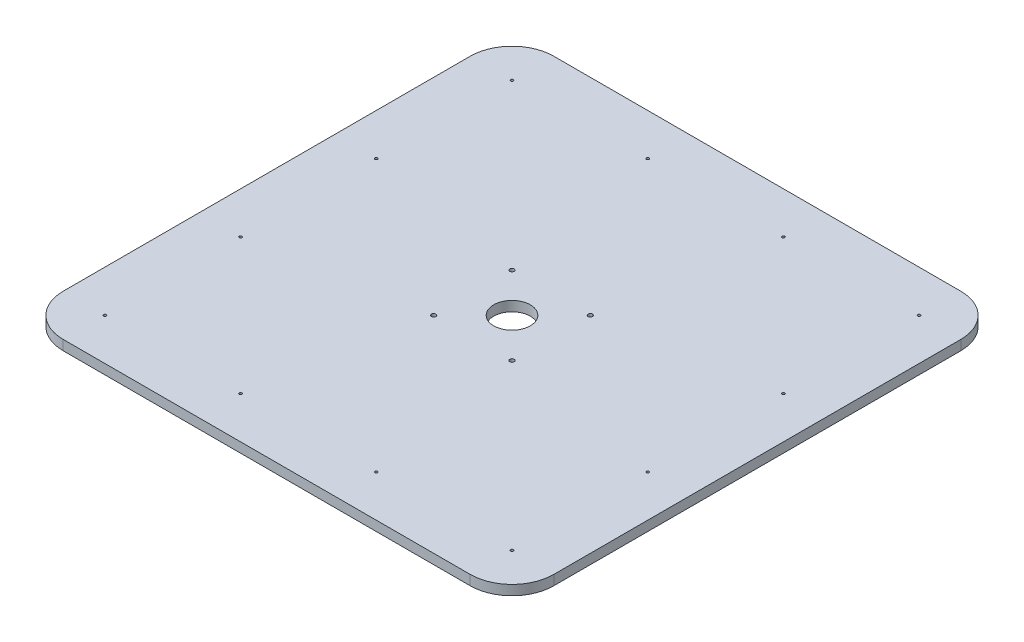
ISO-10303-21;
HEADER;
FILE_DESCRIPTION(('STEP AP214'),'2;1');
FILE_NAME('part.step','',(''),(''),'','','');
FILE_SCHEMA(('AUTOMOTIVE_DESIGN { 1 0 10303 214 1 1 1 1 }'));
ENDSEC;
DATA;
#1=APPLICATION_CONTEXT('core data for automotive mechanical design processes');
#2=APPLICATION_PROTOCOL_DEFINITION('international standard','automotive_design',2000,#1);
#3=PRODUCT_CONTEXT('',#1,'mechanical');
#4=PRODUCT('Part','Part','',(#3));
#5=PRODUCT_RELATED_PRODUCT_CATEGORY('part','',(#4));
#6=PRODUCT_DEFINITION_FORMATION('','',#4);
#7=PRODUCT_DEFINITION_CONTEXT('part definition',#1,'design');
#8=PRODUCT_DEFINITION('design','',#6,#7);
#9=PRODUCT_DEFINITION_SHAPE('','',#8);
#10=(LENGTH_UNIT() NAMED_UNIT(*) SI_UNIT(.MILLI.,.METRE.));
#11=(NAMED_UNIT(*) PLANE_ANGLE_UNIT() SI_UNIT($,.RADIAN.));
#12=(NAMED_UNIT(*) SI_UNIT($,.STERADIAN.) SOLID_ANGLE_UNIT());
#13=UNCERTAINTY_MEASURE_WITH_UNIT(LENGTH_MEASURE(1.E-05),#10,'distance_accuracy_value','');
#14=(GEOMETRIC_REPRESENTATION_CONTEXT(3) GLOBAL_UNCERTAINTY_ASSIGNED_CONTEXT((#13)) GLOBAL_UNIT_ASSIGNED_CONTEXT((#10,
#11,#12)) REPRESENTATION_CONTEXT('',''));
#15=CARTESIAN_POINT('',(0.,0.,0.));
#16=DIRECTION('',(0.,0.,1.));
#17=DIRECTION('',(1.,0.,0.));
#18=AXIS2_PLACEMENT_3D('',#15,#16,#17);
#19=CARTESIAN_POINT('',(0.,12.,0.));
#20=DIRECTION('',(0.,1.,0.));
#21=DIRECTION('',(0.,0.,1.));
#22=AXIS2_PLACEMENT_3D('',#19,#20,#21);
#23=PLANE('',#22);
#24=CARTESIAN_POINT('',(0.,12.,1.11022302462516E-13));
#25=DIRECTION('',(0.,-1.,0.));
#26=DIRECTION('',(0.,0.,-1.));
#27=AXIS2_PLACEMENT_3D('',#24,#25,#26);
#28=CIRCLE('',#27,22.225);
#29=CARTESIAN_POINT('',(0.,12.,-22.2249999999999));
#30=VERTEX_POINT('',#29);
#31=EDGE_CURVE('E109',#30,#30,#28,.T.);
#32=ORIENTED_EDGE('',*,*,#31,.T.);
#33=EDGE_LOOP('',(#32));
#34=FACE_BOUND('',#33,.T.);
#35=DIRECTION('',(0.,0.,1.));
#36=VECTOR('',#35,1.);
#37=CARTESIAN_POINT('',(298.45,12.,298.45));
#38=LINE('',#37,#36);
#39=CARTESIAN_POINT('',(298.45,12.,247.65));
#40=VERTEX_POINT('',#39);
#41=CARTESIAN_POINT('',(298.45,12.,-247.65));
#42=VERTEX_POINT('',#41);
#43=EDGE_CURVE('E115',#40,#42,#38,.F.);
#44=ORIENTED_EDGE('',*,*,#43,.T.);
#45=CARTESIAN_POINT('',(247.65,12.,-247.65));
#46=DIRECTION('',(0.,-1.,0.));
#47=DIRECTION('',(0.,0.,-1.));
#48=AXIS2_PLACEMENT_3D('',#45,#46,#47);
#49=CIRCLE('',#48,50.8);
#50=CARTESIAN_POINT('',(247.65,12.,-298.45));
#51=VERTEX_POINT('',#50);
#52=EDGE_CURVE('E116',#51,#42,#49,.T.);
#53=ORIENTED_EDGE('',*,*,#52,.F.);
#54=DIRECTION('',(1.,0.,0.));
#55=VECTOR('',#54,1.);
#56=CARTESIAN_POINT('',(298.45,12.,-298.45));
#57=LINE('',#56,#55);
#58=CARTESIAN_POINT('',(-247.65,12.,-298.45));
#59=VERTEX_POINT('',#58);
#60=EDGE_CURVE('E110',#51,#59,#57,.F.);
#61=ORIENTED_EDGE('',*,*,#60,.T.);
#62=CARTESIAN_POINT('',(-247.65,12.,-247.65));
#63=DIRECTION('',(0.,-1.,0.));
#64=DIRECTION('',(0.,0.,-1.));
#65=AXIS2_PLACEMENT_3D('',#62,#63,#64);
#66=CIRCLE('',#65,50.8);
#67=CARTESIAN_POINT('',(-298.45,12.,-247.65));
#68=VERTEX_POINT('',#67);
#69=EDGE_CURVE('E113',#68,#59,#66,.T.);
#70=ORIENTED_EDGE('',*,*,#69,.F.);
#71=DIRECTION('',(0.,0.,-1.));
#72=VECTOR('',#71,1.);
#73=CARTESIAN_POINT('',(-298.45,12.,298.45));
#74=LINE('',#73,#72);
#75=CARTESIAN_POINT('',(-298.45,12.,247.65));
#76=VERTEX_POINT('',#75);
#77=EDGE_CURVE('E86',#68,#76,#74,.F.);
#78=ORIENTED_EDGE('',*,*,#77,.T.);
#79=CARTESIAN_POINT('',(-247.65,12.,247.65));
#80=DIRECTION('',(0.,-1.,0.));
#81=DIRECTION('',(0.,0.,-1.));
#82=AXIS2_PLACEMENT_3D('',#79,#80,#81);
#83=CIRCLE('',#82,50.8);
#84=CARTESIAN_POINT('',(-247.65,12.,298.45));
#85=VERTEX_POINT('',#84);
#86=EDGE_CURVE('E80',#85,#76,#83,.T.);
#87=ORIENTED_EDGE('',*,*,#86,.F.);
#88=DIRECTION('',(-1.,0.,0.));
#89=VECTOR('',#88,1.);
#90=CARTESIAN_POINT('',(298.45,12.,298.45));
#91=LINE('',#90,#89);
#92=CARTESIAN_POINT('',(247.65,12.,298.45));
#93=VERTEX_POINT('',#92);
#94=EDGE_CURVE('E84',#85,#93,#91,.F.);
#95=ORIENTED_EDGE('',*,*,#94,.T.);
#96=CARTESIAN_POINT('',(247.65,12.,247.65));
#97=DIRECTION('',(0.,-1.,0.));
#98=DIRECTION('',(0.,0.,-1.));
#99=AXIS2_PLACEMENT_3D('',#96,#97,#98);
#100=CIRCLE('',#99,50.8);
#101=EDGE_CURVE('E99',#40,#93,#100,.T.);
#102=ORIENTED_EDGE('',*,*,#101,.F.);
#103=EDGE_LOOP('',(#44,#53,#61,#70,#78,#87,#95,#102));
#104=FACE_BOUND('',#103,.T.);
#105=CARTESIAN_POINT('',(-247.65,12.,247.65));
#106=DIRECTION('',(0.,-1.,0.));
#107=DIRECTION('',(0.,0.,-1.));
#108=AXIS2_PLACEMENT_3D('',#105,#106,#107);
#109=CIRCLE('',#108,1.65100000000001);
#110=CARTESIAN_POINT('',(-247.65,12.,245.999));
#111=VERTEX_POINT('',#110);
#112=EDGE_CURVE('E92',#111,#111,#109,.T.);
#113=ORIENTED_EDGE('',*,*,#112,.T.);
#114=EDGE_LOOP('',(#113));
#115=FACE_BOUND('',#114,.T.);
#116=CARTESIAN_POINT('',(-82.55,12.,247.65));
#117=DIRECTION('',(0.,-1.,0.));
#118=DIRECTION('',(0.,0.,-1.));
#119=AXIS2_PLACEMENT_3D('',#116,#117,#118);
#120=CIRCLE('',#119,1.65100000000001);
#121=CARTESIAN_POINT('',(-82.55,12.,245.999));
#122=VERTEX_POINT('',#121);
#123=EDGE_CURVE('E189',#122,#122,#120,.T.);
#124=ORIENTED_EDGE('',*,*,#123,.T.);
#125=EDGE_LOOP('',(#124));
#126=FACE_BOUND('',#125,.T.);
#127=CARTESIAN_POINT('',(82.55,12.,247.65));
#128=DIRECTION('',(0.,-1.,0.));
#129=DIRECTION('',(0.,0.,-1.));
#130=AXIS2_PLACEMENT_3D('',#127,#128,#129);
#131=CIRCLE('',#130,1.65100000000001);
#132=CARTESIAN_POINT('',(82.55,12.,245.999));
#133=VERTEX_POINT('',#132);
#134=EDGE_CURVE('E192',#133,#133,#131,.T.);
#135=ORIENTED_EDGE('',*,*,#134,.T.);
#136=EDGE_LOOP('',(#135));
#137=FACE_BOUND('',#136,.T.);
#138=CARTESIAN_POINT('',(247.65,12.,247.65));
#139=DIRECTION('',(0.,-1.,0.));
#140=DIRECTION('',(0.,0.,-1.));
#141=AXIS2_PLACEMENT_3D('',#138,#139,#140);
#142=CIRCLE('',#141,1.65100000000001);
#143=CARTESIAN_POINT('',(247.65,12.,245.999));
#144=VERTEX_POINT('',#143);
#145=EDGE_CURVE('E195',#144,#144,#142,.T.);
#146=ORIENTED_EDGE('',*,*,#145,.T.);
#147=EDGE_LOOP('',(#146));
#148=FACE_BOUND('',#147,.T.);
#149=CARTESIAN_POINT('',(247.65,12.,-82.5499999999999));
#150=DIRECTION('',(0.,-1.,0.));
#151=DIRECTION('',(0.,0.,-1.));
#152=AXIS2_PLACEMENT_3D('',#149,#150,#151);
#153=CIRCLE('',#152,1.65100000000001);
#154=CARTESIAN_POINT('',(247.65,12.,-84.2009999999999));
#155=VERTEX_POINT('',#154);
#156=EDGE_CURVE('E198',#155,#155,#153,.T.);
#157=ORIENTED_EDGE('',*,*,#156,.T.);
#158=EDGE_LOOP('',(#157));
#159=FACE_BOUND('',#158,.T.);
#160=CARTESIAN_POINT('',(247.65,12.,82.5499999999999));
#161=DIRECTION('',(0.,-1.,0.));
#162=DIRECTION('',(0.,0.,-1.));
#163=AXIS2_PLACEMENT_3D('',#160,#161,#162);
#164=CIRCLE('',#163,1.65100000000001);
#165=CARTESIAN_POINT('',(247.65,12.,80.8989999999999));
#166=VERTEX_POINT('',#165);
#167=EDGE_CURVE('E201',#166,#166,#164,.T.);
#168=ORIENTED_EDGE('',*,*,#167,.T.);
#169=EDGE_LOOP('',(#168));
#170=FACE_BOUND('',#169,.T.);
#171=CARTESIAN_POINT('',(247.65,12.,-247.65));
#172=DIRECTION('',(0.,-1.,0.));
#173=DIRECTION('',(0.,0.,-1.));
#174=AXIS2_PLACEMENT_3D('',#171,#172,#173);
#175=CIRCLE('',#174,1.65100000000001);
#176=CARTESIAN_POINT('',(247.65,12.,-249.301));
#177=VERTEX_POINT('',#176);
#178=EDGE_CURVE('E204',#177,#177,#175,.T.);
#179=ORIENTED_EDGE('',*,*,#178,.T.);
#180=EDGE_LOOP('',(#179));
#181=FACE_BOUND('',#180,.T.);
#182=CARTESIAN_POINT('',(82.55,12.,-247.65));
#183=DIRECTION('',(0.,-1.,0.));
#184=DIRECTION('',(0.,0.,-1.));
#185=AXIS2_PLACEMENT_3D('',#182,#183,#184);
#186=CIRCLE('',#185,1.65100000000001);
#187=CARTESIAN_POINT('',(82.55,12.,-249.301));
#188=VERTEX_POINT('',#187);
#189=EDGE_CURVE('E207',#188,#188,#186,.T.);
#190=ORIENTED_EDGE('',*,*,#189,.T.);
#191=EDGE_LOOP('',(#190));
#192=FACE_BOUND('',#191,.T.);
#193=CARTESIAN_POINT('',(-82.55,12.,-247.65));
#194=DIRECTION('',(0.,-1.,0.));
#195=DIRECTION('',(0.,0.,-1.));
#196=AXIS2_PLACEMENT_3D('',#193,#194,#195);
#197=CIRCLE('',#196,1.65100000000001);
#198=CARTESIAN_POINT('',(-82.55,12.,-249.301));
#199=VERTEX_POINT('',#198);
#200=EDGE_CURVE('E210',#199,#199,#197,.T.);
#201=ORIENTED_EDGE('',*,*,#200,.T.);
#202=EDGE_LOOP('',(#201));
#203=FACE_BOUND('',#202,.T.);
#204=CARTESIAN_POINT('',(-247.65,12.,-247.65));
#205=DIRECTION('',(0.,-1.,0.));
#206=DIRECTION('',(0.,0.,-1.));
#207=AXIS2_PLACEMENT_3D('',#204,#205,#206);
#208=CIRCLE('',#207,1.65100000000001);
#209=CARTESIAN_POINT('',(-247.65,12.,-249.301));
#210=VERTEX_POINT('',#209);
#211=EDGE_CURVE('E213',#210,#210,#208,.T.);
#212=ORIENTED_EDGE('',*,*,#211,.T.);
#213=EDGE_LOOP('',(#212));
#214=FACE_BOUND('',#213,.T.);
#215=CARTESIAN_POINT('',(-247.65,12.,-82.5499999999999));
#216=DIRECTION('',(0.,-1.,0.));
#217=DIRECTION('',(0.,0.,-1.));
#218=AXIS2_PLACEMENT_3D('',#215,#216,#217);
#219=CIRCLE('',#218,1.65100000000001);
#220=CARTESIAN_POINT('',(-247.65,12.,-84.2009999999999));
#221=VERTEX_POINT('',#220);
#222=EDGE_CURVE('E216',#221,#221,#219,.T.);
#223=ORIENTED_EDGE('',*,*,#222,.T.);
#224=EDGE_LOOP('',(#223));
#225=FACE_BOUND('',#224,.T.);
#226=CARTESIAN_POINT('',(-247.65,12.,82.5499999999999));
#227=DIRECTION('',(0.,-1.,0.));
#228=DIRECTION('',(0.,0.,-1.));
#229=AXIS2_PLACEMENT_3D('',#226,#227,#228);
#230=CIRCLE('',#229,1.65100000000001);
#231=CARTESIAN_POINT('',(-247.65,12.,80.8989999999999));
#232=VERTEX_POINT('',#231);
#233=EDGE_CURVE('E219',#232,#232,#230,.T.);
#234=ORIENTED_EDGE('',*,*,#233,.T.);
#235=EDGE_LOOP('',(#234));
#236=FACE_BOUND('',#235,.T.);
#237=CARTESIAN_POINT('',(-47.625,12.,-47.625));
#238=DIRECTION('',(0.,-1.,0.));
#239=DIRECTION('',(0.,0.,-1.));
#240=AXIS2_PLACEMENT_3D('',#237,#238,#239);
#241=CIRCLE('',#240,2.667);
#242=CARTESIAN_POINT('',(-47.625,12.,-50.292));
#243=VERTEX_POINT('',#242);
#244=EDGE_CURVE('E222',#243,#243,#241,.T.);
#245=ORIENTED_EDGE('',*,*,#244,.T.);
#246=EDGE_LOOP('',(#245));
#247=FACE_BOUND('',#246,.T.);
#248=CARTESIAN_POINT('',(47.625,12.,-47.625));
#249=DIRECTION('',(0.,-1.,0.));
#250=DIRECTION('',(0.,0.,-1.));
#251=AXIS2_PLACEMENT_3D('',#248,#249,#250);
#252=CIRCLE('',#251,2.667);
#253=CARTESIAN_POINT('',(47.625,12.,-50.292));
#254=VERTEX_POINT('',#253);
#255=EDGE_CURVE('E225',#254,#254,#252,.T.);
#256=ORIENTED_EDGE('',*,*,#255,.T.);
#257=EDGE_LOOP('',(#256));
#258=FACE_BOUND('',#257,.T.);
#259=CARTESIAN_POINT('',(47.625,12.,47.625));
#260=DIRECTION('',(0.,-1.,0.));
#261=DIRECTION('',(0.,0.,-1.));
#262=AXIS2_PLACEMENT_3D('',#259,#260,#261);
#263=CIRCLE('',#262,2.667);
#264=CARTESIAN_POINT('',(47.625,12.,44.958));
#265=VERTEX_POINT('',#264);
#266=EDGE_CURVE('E227',#265,#265,#263,.T.);
#267=ORIENTED_EDGE('',*,*,#266,.T.);
#268=EDGE_LOOP('',(#267));
#269=FACE_BOUND('',#268,.T.);
#270=CARTESIAN_POINT('',(-47.625,12.,47.625));
#271=DIRECTION('',(0.,-1.,0.));
#272=DIRECTION('',(0.,0.,-1.));
#273=AXIS2_PLACEMENT_3D('',#270,#271,#272);
#274=CIRCLE('',#273,2.667);
#275=CARTESIAN_POINT('',(-47.625,12.,44.958));
#276=VERTEX_POINT('',#275);
#277=EDGE_CURVE('E19',#276,#276,#274,.T.);
#278=ORIENTED_EDGE('',*,*,#277,.T.);
#279=EDGE_LOOP('',(#278));
#280=FACE_BOUND('',#279,.T.);
#281=ADVANCED_FACE('F16',(#34,#104,#115,#126,#137,#148,#159,#170,#181,#192,#203,#214,#225,#236,
#247,#258,#269,#280),#23,.T.);
#282=CARTESIAN_POINT('',(-47.625,12.,47.625));
#283=DIRECTION('',(0.,-1.,0.));
#284=DIRECTION('',(0.,0.,-1.));
#285=AXIS2_PLACEMENT_3D('',#282,#283,#284);
#286=CYLINDRICAL_SURFACE('',#285,2.667);
#287=ORIENTED_EDGE('',*,*,#277,.F.);
#288=EDGE_LOOP('',(#287));
#289=FACE_BOUND('',#288,.T.);
#290=CARTESIAN_POINT('',(-47.625,0.,47.625));
#291=DIRECTION('',(0.,-1.,0.));
#292=DIRECTION('',(0.,0.,-1.));
#293=AXIS2_PLACEMENT_3D('',#290,#291,#292);
#294=CIRCLE('',#293,2.667);
#295=CARTESIAN_POINT('',(-47.625,0.,44.958));
#296=VERTEX_POINT('',#295);
#297=EDGE_CURVE('E177',#296,#296,#294,.T.);
#298=ORIENTED_EDGE('',*,*,#297,.T.);
#299=EDGE_LOOP('',(#298));
#300=FACE_BOUND('',#299,.T.);
#301=ADVANCED_FACE('F235',(#289,#300),#286,.F.);
#302=CARTESIAN_POINT('',(47.625,12.,47.625));
#303=DIRECTION('',(0.,-1.,0.));
#304=DIRECTION('',(0.,0.,-1.));
#305=AXIS2_PLACEMENT_3D('',#302,#303,#304);
#306=CYLINDRICAL_SURFACE('',#305,2.667);
#307=ORIENTED_EDGE('',*,*,#266,.F.);
#308=EDGE_LOOP('',(#307));
#309=FACE_BOUND('',#308,.T.);
#310=CARTESIAN_POINT('',(47.625,0.,47.625));
#311=DIRECTION('',(0.,-1.,0.));
#312=DIRECTION('',(0.,0.,-1.));
#313=AXIS2_PLACEMENT_3D('',#310,#311,#312);
#314=CIRCLE('',#313,2.667);
#315=CARTESIAN_POINT('',(47.625,0.,44.958));
#316=VERTEX_POINT('',#315);
#317=EDGE_CURVE('E174',#316,#316,#314,.T.);
#318=ORIENTED_EDGE('',*,*,#317,.T.);
#319=EDGE_LOOP('',(#318));
#320=FACE_BOUND('',#319,.T.);
#321=ADVANCED_FACE('F238',(#309,#320),#306,.F.);
#322=CARTESIAN_POINT('',(47.625,12.,-47.625));
#323=DIRECTION('',(0.,-1.,0.));
#324=DIRECTION('',(0.,0.,-1.));
#325=AXIS2_PLACEMENT_3D('',#322,#323,#324);
#326=CYLINDRICAL_SURFACE('',#325,2.667);
#327=ORIENTED_EDGE('',*,*,#255,.F.);
#328=EDGE_LOOP('',(#327));
#329=FACE_BOUND('',#328,.T.);
#330=CARTESIAN_POINT('',(47.625,0.,-47.625));
#331=DIRECTION('',(0.,-1.,0.));
#332=DIRECTION('',(0.,0.,-1.));
#333=AXIS2_PLACEMENT_3D('',#330,#331,#332);
#334=CIRCLE('',#333,2.667);
#335=CARTESIAN_POINT('',(47.625,0.,-50.292));
#336=VERTEX_POINT('',#335);
#337=EDGE_CURVE('E171',#336,#336,#334,.T.);
#338=ORIENTED_EDGE('',*,*,#337,.T.);
#339=EDGE_LOOP('',(#338));
#340=FACE_BOUND('',#339,.T.);
#341=ADVANCED_FACE('F333',(#329,#340),#326,.F.);
#342=CARTESIAN_POINT('',(-47.625,12.,-47.625));
#343=DIRECTION('',(0.,-1.,0.));
#344=DIRECTION('',(0.,0.,-1.));
#345=AXIS2_PLACEMENT_3D('',#342,#343,#344);
#346=CYLINDRICAL_SURFACE('',#345,2.667);
#347=ORIENTED_EDGE('',*,*,#244,.F.);
#348=EDGE_LOOP('',(#347));
#349=FACE_BOUND('',#348,.T.);
#350=CARTESIAN_POINT('',(-47.625,0.,-47.625));
#351=DIRECTION('',(0.,-1.,0.));
#352=DIRECTION('',(0.,0.,-1.));
#353=AXIS2_PLACEMENT_3D('',#350,#351,#352);
#354=CIRCLE('',#353,2.667);
#355=CARTESIAN_POINT('',(-47.625,0.,-50.292));
#356=VERTEX_POINT('',#355);
#357=EDGE_CURVE('E168',#356,#356,#354,.T.);
#358=ORIENTED_EDGE('',*,*,#357,.T.);
#359=EDGE_LOOP('',(#358));
#360=FACE_BOUND('',#359,.T.);
#361=ADVANCED_FACE('F329',(#349,#360),#346,.F.);
#362=CARTESIAN_POINT('',(-247.65,12.,82.5499999999999));
#363=DIRECTION('',(0.,-1.,0.));
#364=DIRECTION('',(0.,0.,-1.));
#365=AXIS2_PLACEMENT_3D('',#362,#363,#364);
#366=CYLINDRICAL_SURFACE('',#365,1.65100000000001);
#367=ORIENTED_EDGE('',*,*,#233,.F.);
#368=EDGE_LOOP('',(#367));
#369=FACE_BOUND('',#368,.T.);
#370=CARTESIAN_POINT('',(-247.65,0.,82.5499999999999));
#371=DIRECTION('',(0.,-1.,0.));
#372=DIRECTION('',(0.,0.,-1.));
#373=AXIS2_PLACEMENT_3D('',#370,#371,#372);
#374=CIRCLE('',#373,1.65100000000001);
#375=CARTESIAN_POINT('',(-247.65,0.,80.8989999999999));
#376=VERTEX_POINT('',#375);
#377=EDGE_CURVE('E165',#376,#376,#374,.T.);
#378=ORIENTED_EDGE('',*,*,#377,.T.);
#379=EDGE_LOOP('',(#378));
#380=FACE_BOUND('',#379,.T.);
#381=ADVANCED_FACE('F325',(#369,#380),#366,.F.);
#382=CARTESIAN_POINT('',(-247.65,12.,-82.5499999999999));
#383=DIRECTION('',(0.,-1.,0.));
#384=DIRECTION('',(0.,0.,-1.));
#385=AXIS2_PLACEMENT_3D('',#382,#383,#384);
#386=CYLINDRICAL_SURFACE('',#385,1.65100000000001);
#387=ORIENTED_EDGE('',*,*,#222,.F.);
#388=EDGE_LOOP('',(#387));
#389=FACE_BOUND('',#388,.T.);
#390=CARTESIAN_POINT('',(-247.65,0.,-82.5499999999999));
#391=DIRECTION('',(0.,-1.,0.));
#392=DIRECTION('',(0.,0.,-1.));
#393=AXIS2_PLACEMENT_3D('',#390,#391,#392);
#394=CIRCLE('',#393,1.65100000000001);
#395=CARTESIAN_POINT('',(-247.65,0.,-84.2009999999999));
#396=VERTEX_POINT('',#395);
#397=EDGE_CURVE('E162',#396,#396,#394,.T.);
#398=ORIENTED_EDGE('',*,*,#397,.T.);
#399=EDGE_LOOP('',(#398));
#400=FACE_BOUND('',#399,.T.);
#401=ADVANCED_FACE('F321',(#389,#400),#386,.F.);
#402=CARTESIAN_POINT('',(-247.65,12.,-247.65));
#403=DIRECTION('',(0.,-1.,0.));
#404=DIRECTION('',(0.,0.,-1.));
#405=AXIS2_PLACEMENT_3D('',#402,#403,#404);
#406=CYLINDRICAL_SURFACE('',#405,1.65100000000001);
#407=ORIENTED_EDGE('',*,*,#211,.F.);
#408=EDGE_LOOP('',(#407));
#409=FACE_BOUND('',#408,.T.);
#410=CARTESIAN_POINT('',(-247.65,0.,-247.65));
#411=DIRECTION('',(0.,-1.,0.));
#412=DIRECTION('',(0.,0.,-1.));
#413=AXIS2_PLACEMENT_3D('',#410,#411,#412);
#414=CIRCLE('',#413,1.65100000000001);
#415=CARTESIAN_POINT('',(-247.65,0.,-249.301));
#416=VERTEX_POINT('',#415);
#417=EDGE_CURVE('E159',#416,#416,#414,.T.);
#418=ORIENTED_EDGE('',*,*,#417,.T.);
#419=EDGE_LOOP('',(#418));
#420=FACE_BOUND('',#419,.T.);
#421=ADVANCED_FACE('F317',(#409,#420),#406,.F.);
#422=CARTESIAN_POINT('',(-82.55,12.,-247.65));
#423=DIRECTION('',(0.,-1.,0.));
#424=DIRECTION('',(0.,0.,-1.));
#425=AXIS2_PLACEMENT_3D('',#422,#423,#424);
#426=CYLINDRICAL_SURFACE('',#425,1.65100000000001);
#427=ORIENTED_EDGE('',*,*,#200,.F.);
#428=EDGE_LOOP('',(#427));
#429=FACE_BOUND('',#428,.T.);
#430=CARTESIAN_POINT('',(-82.55,0.,-247.65));
#431=DIRECTION('',(0.,-1.,0.));
#432=DIRECTION('',(0.,0.,-1.));
#433=AXIS2_PLACEMENT_3D('',#430,#431,#432);
#434=CIRCLE('',#433,1.65100000000001);
#435=CARTESIAN_POINT('',(-82.55,0.,-249.301));
#436=VERTEX_POINT('',#435);
#437=EDGE_CURVE('E156',#436,#436,#434,.T.);
#438=ORIENTED_EDGE('',*,*,#437,.T.);
#439=EDGE_LOOP('',(#438));
#440=FACE_BOUND('',#439,.T.);
#441=ADVANCED_FACE('F313',(#429,#440),#426,.F.);
#442=CARTESIAN_POINT('',(82.55,12.,-247.65));
#443=DIRECTION('',(0.,-1.,0.));
#444=DIRECTION('',(0.,0.,-1.));
#445=AXIS2_PLACEMENT_3D('',#442,#443,#444);
#446=CYLINDRICAL_SURFACE('',#445,1.65100000000001);
#447=ORIENTED_EDGE('',*,*,#189,.F.);
#448=EDGE_LOOP('',(#447));
#449=FACE_BOUND('',#448,.T.);
#450=CARTESIAN_POINT('',(82.55,0.,-247.65));
#451=DIRECTION('',(0.,-1.,0.));
#452=DIRECTION('',(0.,0.,-1.));
#453=AXIS2_PLACEMENT_3D('',#450,#451,#452);
#454=CIRCLE('',#453,1.65100000000001);
#455=CARTESIAN_POINT('',(82.55,0.,-249.301));
#456=VERTEX_POINT('',#455);
#457=EDGE_CURVE('E153',#456,#456,#454,.T.);
#458=ORIENTED_EDGE('',*,*,#457,.T.);
#459=EDGE_LOOP('',(#458));
#460=FACE_BOUND('',#459,.T.);
#461=ADVANCED_FACE('F309',(#449,#460),#446,.F.);
#462=CARTESIAN_POINT('',(247.65,12.,-247.65));
#463=DIRECTION('',(0.,-1.,0.));
#464=DIRECTION('',(0.,0.,-1.));
#465=AXIS2_PLACEMENT_3D('',#462,#463,#464);
#466=CYLINDRICAL_SURFACE('',#465,1.65100000000001);
#467=ORIENTED_EDGE('',*,*,#178,.F.);
#468=EDGE_LOOP('',(#467));
#469=FACE_BOUND('',#468,.T.);
#470=CARTESIAN_POINT('',(247.65,0.,-247.65));
#471=DIRECTION('',(0.,-1.,0.));
#472=DIRECTION('',(0.,0.,-1.));
#473=AXIS2_PLACEMENT_3D('',#470,#471,#472);
#474=CIRCLE('',#473,1.65100000000001);
#475=CARTESIAN_POINT('',(247.65,0.,-249.301));
#476=VERTEX_POINT('',#475);
#477=EDGE_CURVE('E150',#476,#476,#474,.T.);
#478=ORIENTED_EDGE('',*,*,#477,.T.);
#479=EDGE_LOOP('',(#478));
#480=FACE_BOUND('',#479,.T.);
#481=ADVANCED_FACE('F305',(#469,#480),#466,.F.);
#482=CARTESIAN_POINT('',(247.65,12.,82.5499999999999));
#483=DIRECTION('',(0.,-1.,0.));
#484=DIRECTION('',(0.,0.,-1.));
#485=AXIS2_PLACEMENT_3D('',#482,#483,#484);
#486=CYLINDRICAL_SURFACE('',#485,1.65100000000001);
#487=ORIENTED_EDGE('',*,*,#167,.F.);
#488=EDGE_LOOP('',(#487));
#489=FACE_BOUND('',#488,.T.);
#490=CARTESIAN_POINT('',(247.65,0.,82.5499999999999));
#491=DIRECTION('',(0.,-1.,0.));
#492=DIRECTION('',(0.,0.,-1.));
#493=AXIS2_PLACEMENT_3D('',#490,#491,#492);
#494=CIRCLE('',#493,1.65100000000001);
#495=CARTESIAN_POINT('',(247.65,0.,80.8989999999999));
#496=VERTEX_POINT('',#495);
#497=EDGE_CURVE('E147',#496,#496,#494,.T.);
#498=ORIENTED_EDGE('',*,*,#497,.T.);
#499=EDGE_LOOP('',(#498));
#500=FACE_BOUND('',#499,.T.);
#501=ADVANCED_FACE('F301',(#489,#500),#486,.F.);
#502=CARTESIAN_POINT('',(247.65,12.,-82.5499999999999));
#503=DIRECTION('',(0.,-1.,0.));
#504=DIRECTION('',(0.,0.,-1.));
#505=AXIS2_PLACEMENT_3D('',#502,#503,#504);
#506=CYLINDRICAL_SURFACE('',#505,1.65100000000001);
#507=ORIENTED_EDGE('',*,*,#156,.F.);
#508=EDGE_LOOP('',(#507));
#509=FACE_BOUND('',#508,.T.);
#510=CARTESIAN_POINT('',(247.65,0.,-82.5499999999999));
#511=DIRECTION('',(0.,-1.,0.));
#512=DIRECTION('',(0.,0.,-1.));
#513=AXIS2_PLACEMENT_3D('',#510,#511,#512);
#514=CIRCLE('',#513,1.65100000000001);
#515=CARTESIAN_POINT('',(247.65,0.,-84.2009999999999));
#516=VERTEX_POINT('',#515);
#517=EDGE_CURVE('E144',#516,#516,#514,.T.);
#518=ORIENTED_EDGE('',*,*,#517,.T.);
#519=EDGE_LOOP('',(#518));
#520=FACE_BOUND('',#519,.T.);
#521=ADVANCED_FACE('F297',(#509,#520),#506,.F.);
#522=CARTESIAN_POINT('',(247.65,12.,247.65));
#523=DIRECTION('',(0.,-1.,0.));
#524=DIRECTION('',(0.,0.,-1.));
#525=AXIS2_PLACEMENT_3D('',#522,#523,#524);
#526=CYLINDRICAL_SURFACE('',#525,1.65100000000001);
#527=ORIENTED_EDGE('',*,*,#145,.F.);
#528=EDGE_LOOP('',(#527));
#529=FACE_BOUND('',#528,.T.);
#530=CARTESIAN_POINT('',(247.65,0.,247.65));
#531=DIRECTION('',(0.,-1.,0.));
#532=DIRECTION('',(0.,0.,-1.));
#533=AXIS2_PLACEMENT_3D('',#530,#531,#532);
#534=CIRCLE('',#533,1.65100000000001);
#535=CARTESIAN_POINT('',(247.65,0.,245.999));
#536=VERTEX_POINT('',#535);
#537=EDGE_CURVE('E141',#536,#536,#534,.T.);
#538=ORIENTED_EDGE('',*,*,#537,.T.);
#539=EDGE_LOOP('',(#538));
#540=FACE_BOUND('',#539,.T.);
#541=ADVANCED_FACE('F293',(#529,#540),#526,.F.);
#542=CARTESIAN_POINT('',(82.55,12.,247.65));
#543=DIRECTION('',(0.,-1.,0.));
#544=DIRECTION('',(0.,0.,-1.));
#545=AXIS2_PLACEMENT_3D('',#542,#543,#544);
#546=CYLINDRICAL_SURFACE('',#545,1.65100000000001);
#547=ORIENTED_EDGE('',*,*,#134,.F.);
#548=EDGE_LOOP('',(#547));
#549=FACE_BOUND('',#548,.T.);
#550=CARTESIAN_POINT('',(82.55,0.,247.65));
#551=DIRECTION('',(0.,-1.,0.));
#552=DIRECTION('',(0.,0.,-1.));
#553=AXIS2_PLACEMENT_3D('',#550,#551,#552);
#554=CIRCLE('',#553,1.65100000000001);
#555=CARTESIAN_POINT('',(82.55,0.,245.999));
#556=VERTEX_POINT('',#555);
#557=EDGE_CURVE('E138',#556,#556,#554,.T.);
#558=ORIENTED_EDGE('',*,*,#557,.T.);
#559=EDGE_LOOP('',(#558));
#560=FACE_BOUND('',#559,.T.);
#561=ADVANCED_FACE('F289',(#549,#560),#546,.F.);
#562=CARTESIAN_POINT('',(-82.55,12.,247.65));
#563=DIRECTION('',(0.,-1.,0.));
#564=DIRECTION('',(0.,0.,-1.));
#565=AXIS2_PLACEMENT_3D('',#562,#563,#564);
#566=CYLINDRICAL_SURFACE('',#565,1.65100000000001);
#567=ORIENTED_EDGE('',*,*,#123,.F.);
#568=EDGE_LOOP('',(#567));
#569=FACE_BOUND('',#568,.T.);
#570=CARTESIAN_POINT('',(-82.55,0.,247.65));
#571=DIRECTION('',(0.,-1.,0.));
#572=DIRECTION('',(0.,0.,-1.));
#573=AXIS2_PLACEMENT_3D('',#570,#571,#572);
#574=CIRCLE('',#573,1.65100000000001);
#575=CARTESIAN_POINT('',(-82.55,0.,245.999));
#576=VERTEX_POINT('',#575);
#577=EDGE_CURVE('E135',#576,#576,#574,.T.);
#578=ORIENTED_EDGE('',*,*,#577,.T.);
#579=EDGE_LOOP('',(#578));
#580=FACE_BOUND('',#579,.T.);
#581=ADVANCED_FACE('F285',(#569,#580),#566,.F.);
#582=CARTESIAN_POINT('',(-247.65,12.,247.65));
#583=DIRECTION('',(0.,-1.,0.));
#584=DIRECTION('',(0.,0.,-1.));
#585=AXIS2_PLACEMENT_3D('',#582,#583,#584);
#586=CYLINDRICAL_SURFACE('',#585,1.65100000000001);
#587=ORIENTED_EDGE('',*,*,#112,.F.);
#588=EDGE_LOOP('',(#587));
#589=FACE_BOUND('',#588,.T.);
#590=CARTESIAN_POINT('',(-247.65,0.,247.65));
#591=DIRECTION('',(0.,-1.,0.));
#592=DIRECTION('',(0.,0.,-1.));
#593=AXIS2_PLACEMENT_3D('',#590,#591,#592);
#594=CIRCLE('',#593,1.65100000000001);
#595=CARTESIAN_POINT('',(-247.65,0.,245.999));
#596=VERTEX_POINT('',#595);
#597=EDGE_CURVE('E132',#596,#596,#594,.T.);
#598=ORIENTED_EDGE('',*,*,#597,.T.);
#599=EDGE_LOOP('',(#598));
#600=FACE_BOUND('',#599,.T.);
#601=ADVANCED_FACE('F282',(#589,#600),#586,.F.);
#602=CARTESIAN_POINT('',(-247.65,12.,247.65));
#603=DIRECTION('',(0.,-1.,0.));
#604=DIRECTION('',(0.,0.,-1.));
#605=AXIS2_PLACEMENT_3D('',#602,#603,#604);
#606=CYLINDRICAL_SURFACE('',#605,50.8);
#607=CARTESIAN_POINT('',(-247.65,0.,247.65));
#608=DIRECTION('',(0.,-1.,0.));
#609=DIRECTION('',(0.,0.,-1.));
#610=AXIS2_PLACEMENT_3D('',#607,#608,#609);
#611=CIRCLE('',#610,50.8);
#612=CARTESIAN_POINT('',(-298.45,0.,247.65));
#613=VERTEX_POINT('',#612);
#614=CARTESIAN_POINT('',(-247.65,0.,298.45));
#615=VERTEX_POINT('',#614);
#616=EDGE_CURVE('E103',#613,#615,#611,.F.);
#617=ORIENTED_EDGE('',*,*,#616,.T.);
#618=DIRECTION('',(0.,1.,0.));
#619=VECTOR('',#618,1.);
#620=CARTESIAN_POINT('',(-247.65,12.,298.45));
#621=LINE('',#620,#619);
#622=EDGE_CURVE('E91',#615,#85,#621,.T.);
#623=ORIENTED_EDGE('',*,*,#622,.T.);
#624=ORIENTED_EDGE('',*,*,#86,.T.);
#625=DIRECTION('',(0.,1.,0.));
#626=VECTOR('',#625,1.);
#627=CARTESIAN_POINT('',(-298.45,12.,247.65));
#628=LINE('',#627,#626);
#629=EDGE_CURVE('E599',#76,#613,#628,.F.);
#630=ORIENTED_EDGE('',*,*,#629,.T.);
#631=EDGE_LOOP('',(#617,#623,#624,#630));
#632=FACE_BOUND('',#631,.T.);
#633=ADVANCED_FACE('F102',(#632),#606,.T.);
#634=CARTESIAN_POINT('',(298.45,12.,298.45));
#635=DIRECTION('',(0.,0.,-1.));
#636=DIRECTION('',(-1.,0.,0.));
#637=AXIS2_PLACEMENT_3D('',#634,#635,#636);
#638=PLANE('',#637);
#639=ORIENTED_EDGE('',*,*,#622,.F.);
#640=DIRECTION('',(1.,0.,0.));
#641=VECTOR('',#640,1.);
#642=CARTESIAN_POINT('',(0.,0.,298.45));
#643=LINE('',#642,#641);
#644=CARTESIAN_POINT('',(247.65,0.,298.45));
#645=VERTEX_POINT('',#644);
#646=EDGE_CURVE('E130',#615,#645,#643,.T.);
#647=ORIENTED_EDGE('',*,*,#646,.T.);
#648=DIRECTION('',(0.,-1.,0.));
#649=VECTOR('',#648,1.);
#650=CARTESIAN_POINT('',(247.65,12.,298.45));
#651=LINE('',#650,#649);
#652=EDGE_CURVE('E98',#93,#645,#651,.T.);
#653=ORIENTED_EDGE('',*,*,#652,.F.);
#654=ORIENTED_EDGE('',*,*,#94,.F.);
#655=EDGE_LOOP('',(#639,#647,#653,#654));
#656=FACE_BOUND('',#655,.T.);
#657=ADVANCED_FACE('F95',(#656),#638,.F.);
#658=CARTESIAN_POINT('',(247.65,12.,247.65));
#659=DIRECTION('',(0.,-1.,0.));
#660=DIRECTION('',(0.,0.,-1.));
#661=AXIS2_PLACEMENT_3D('',#658,#659,#660);
#662=CYLINDRICAL_SURFACE('',#661,50.8);
#663=CARTESIAN_POINT('',(247.65,0.,247.65));
#664=DIRECTION('',(0.,-1.,0.));
#665=DIRECTION('',(0.,0.,-1.));
#666=AXIS2_PLACEMENT_3D('',#663,#664,#665);
#667=CIRCLE('',#666,50.8);
#668=CARTESIAN_POINT('',(298.45,0.,247.65));
#669=VERTEX_POINT('',#668);
#670=EDGE_CURVE('E127',#645,#669,#667,.F.);
#671=ORIENTED_EDGE('',*,*,#670,.T.);
#672=DIRECTION('',(0.,1.,0.));
#673=VECTOR('',#672,1.);
#674=CARTESIAN_POINT('',(298.45,12.,247.65));
#675=LINE('',#674,#673);
#676=EDGE_CURVE('E117',#669,#40,#675,.T.);
#677=ORIENTED_EDGE('',*,*,#676,.T.);
#678=ORIENTED_EDGE('',*,*,#101,.T.);
#679=ORIENTED_EDGE('',*,*,#652,.T.);
#680=EDGE_LOOP('',(#671,#677,#678,#679));
#681=FACE_BOUND('',#680,.T.);
#682=ADVANCED_FACE('F273',(#681),#662,.T.);
#683=CARTESIAN_POINT('',(298.45,12.,298.45));
#684=DIRECTION('',(-1.,0.,0.));
#685=DIRECTION('',(0.,0.,1.));
#686=AXIS2_PLACEMENT_3D('',#683,#684,#685);
#687=PLANE('',#686);
#688=DIRECTION('',(0.,-1.,0.));
#689=VECTOR('',#688,1.);
#690=CARTESIAN_POINT('',(298.45,12.,-247.65));
#691=LINE('',#690,#689);
#692=CARTESIAN_POINT('',(298.45,0.,-247.65));
#693=VERTEX_POINT('',#692);
#694=EDGE_CURVE('E185',#42,#693,#691,.T.);
#695=ORIENTED_EDGE('',*,*,#694,.F.);
#696=ORIENTED_EDGE('',*,*,#43,.F.);
#697=ORIENTED_EDGE('',*,*,#676,.F.);
#698=DIRECTION('',(0.,0.,1.));
#699=VECTOR('',#698,1.);
#700=CARTESIAN_POINT('',(298.45,0.,0.));
#701=LINE('',#700,#699);
#702=EDGE_CURVE('E126',#669,#693,#701,.F.);
#703=ORIENTED_EDGE('',*,*,#702,.T.);
#704=EDGE_LOOP('',(#695,#696,#697,#703));
#705=FACE_BOUND('',#704,.T.);
#706=ADVANCED_FACE('F269',(#705),#687,.F.);
#707=CARTESIAN_POINT('',(247.65,12.,-247.65));
#708=DIRECTION('',(0.,-1.,0.));
#709=DIRECTION('',(0.,0.,-1.));
#710=AXIS2_PLACEMENT_3D('',#707,#708,#709);
#711=CYLINDRICAL_SURFACE('',#710,50.8);
#712=CARTESIAN_POINT('',(247.65,0.,-247.65));
#713=DIRECTION('',(0.,-1.,0.));
#714=DIRECTION('',(0.,0.,-1.));
#715=AXIS2_PLACEMENT_3D('',#712,#713,#714);
#716=CIRCLE('',#715,50.8);
#717=CARTESIAN_POINT('',(247.65,0.,-298.45));
#718=VERTEX_POINT('',#717);
#719=EDGE_CURVE('E123',#693,#718,#716,.F.);
#720=ORIENTED_EDGE('',*,*,#719,.T.);
#721=DIRECTION('',(0.,1.,0.));
#722=VECTOR('',#721,1.);
#723=CARTESIAN_POINT('',(247.65,12.,-298.45));
#724=LINE('',#723,#722);
#725=EDGE_CURVE('E114',#718,#51,#724,.T.);
#726=ORIENTED_EDGE('',*,*,#725,.T.);
#727=ORIENTED_EDGE('',*,*,#52,.T.);
#728=ORIENTED_EDGE('',*,*,#694,.T.);
#729=EDGE_LOOP('',(#720,#726,#727,#728));
#730=FACE_BOUND('',#729,.T.);
#731=ADVANCED_FACE('F265',(#730),#711,.T.);
#732=CARTESIAN_POINT('',(298.45,12.,-298.45));
#733=DIRECTION('',(0.,0.,1.));
#734=DIRECTION('',(1.,0.,0.));
#735=AXIS2_PLACEMENT_3D('',#732,#733,#734);
#736=PLANE('',#735);
#737=DIRECTION('',(0.,-1.,0.));
#738=VECTOR('',#737,1.);
#739=CARTESIAN_POINT('',(-247.65,12.,-298.45));
#740=LINE('',#739,#738);
#741=CARTESIAN_POINT('',(-247.65,0.,-298.45));
#742=VERTEX_POINT('',#741);
#743=EDGE_CURVE('E183',#59,#742,#740,.T.);
#744=ORIENTED_EDGE('',*,*,#743,.F.);
#745=ORIENTED_EDGE('',*,*,#60,.F.);
#746=ORIENTED_EDGE('',*,*,#725,.F.);
#747=DIRECTION('',(1.,0.,0.));
#748=VECTOR('',#747,1.);
#749=CARTESIAN_POINT('',(0.,0.,-298.45));
#750=LINE('',#749,#748);
#751=EDGE_CURVE('E122',#718,#742,#750,.F.);
#752=ORIENTED_EDGE('',*,*,#751,.T.);
#753=EDGE_LOOP('',(#744,#745,#746,#752));
#754=FACE_BOUND('',#753,.T.);
#755=ADVANCED_FACE('F261',(#754),#736,.F.);
#756=CARTESIAN_POINT('',(-247.65,12.,-247.65));
#757=DIRECTION('',(0.,-1.,0.));
#758=DIRECTION('',(0.,0.,-1.));
#759=AXIS2_PLACEMENT_3D('',#756,#757,#758);
#760=CYLINDRICAL_SURFACE('',#759,50.8);
#761=CARTESIAN_POINT('',(-247.65,0.,-247.65));
#762=DIRECTION('',(0.,-1.,0.));
#763=DIRECTION('',(0.,0.,-1.));
#764=AXIS2_PLACEMENT_3D('',#761,#762,#763);
#765=CIRCLE('',#764,50.8);
#766=CARTESIAN_POINT('',(-298.45,0.,-247.65));
#767=VERTEX_POINT('',#766);
#768=EDGE_CURVE('E119',#742,#767,#765,.F.);
#769=ORIENTED_EDGE('',*,*,#768,.T.);
#770=DIRECTION('',(0.,1.,0.));
#771=VECTOR('',#770,1.);
#772=CARTESIAN_POINT('',(-298.45,12.,-247.65));
#773=LINE('',#772,#771);
#774=EDGE_CURVE('E34',#767,#68,#773,.T.);
#775=ORIENTED_EDGE('',*,*,#774,.T.);
#776=ORIENTED_EDGE('',*,*,#69,.T.);
#777=ORIENTED_EDGE('',*,*,#743,.T.);
#778=EDGE_LOOP('',(#769,#775,#776,#777));
#779=FACE_BOUND('',#778,.T.);
#780=ADVANCED_FACE('F258',(#779),#760,.T.);
#781=CARTESIAN_POINT('',(-298.45,12.,298.45));
#782=DIRECTION('',(1.,0.,0.));
#783=DIRECTION('',(0.,0.,-1.));
#784=AXIS2_PLACEMENT_3D('',#781,#782,#783);
#785=PLANE('',#784);
#786=ORIENTED_EDGE('',*,*,#774,.F.);
#787=DIRECTION('',(0.,0.,1.));
#788=VECTOR('',#787,1.);
#789=CARTESIAN_POINT('',(-298.45,0.,0.));
#790=LINE('',#789,#788);
#791=EDGE_CURVE('E25',#767,#613,#790,.T.);
#792=ORIENTED_EDGE('',*,*,#791,.T.);
#793=ORIENTED_EDGE('',*,*,#629,.F.);
#794=ORIENTED_EDGE('',*,*,#77,.F.);
#795=EDGE_LOOP('',(#786,#792,#793,#794));
#796=FACE_BOUND('',#795,.T.);
#797=ADVANCED_FACE('F250',(#796),#785,.F.);
#798=CARTESIAN_POINT('',(0.,12.,1.11022302462516E-13));
#799=DIRECTION('',(0.,-1.,0.));
#800=DIRECTION('',(0.,0.,-1.));
#801=AXIS2_PLACEMENT_3D('',#798,#799,#800);
#802=CYLINDRICAL_SURFACE('',#801,22.225);
#803=CARTESIAN_POINT('',(0.,0.,1.11022302462516E-13));
#804=DIRECTION('',(0.,-1.,0.));
#805=DIRECTION('',(0.,0.,-1.));
#806=AXIS2_PLACEMENT_3D('',#803,#804,#805);
#807=CIRCLE('',#806,22.225);
#808=CARTESIAN_POINT('',(0.,0.,-22.2249999999999));
#809=VERTEX_POINT('',#808);
#810=EDGE_CURVE('E11',#809,#809,#807,.T.);
#811=ORIENTED_EDGE('',*,*,#810,.T.);
#812=EDGE_LOOP('',(#811));
#813=FACE_BOUND('',#812,.T.);
#814=ORIENTED_EDGE('',*,*,#31,.F.);
#815=EDGE_LOOP('',(#814));
#816=FACE_BOUND('',#815,.T.);
#817=ADVANCED_FACE('F243',(#813,#816),#802,.F.);
#818=CARTESIAN_POINT('',(0.,0.,0.));
#819=DIRECTION('',(0.,1.,0.));
#820=DIRECTION('',(0.,0.,1.));
#821=AXIS2_PLACEMENT_3D('',#818,#819,#820);
#822=PLANE('',#821);
#823=ORIENTED_EDGE('',*,*,#810,.F.);
#824=EDGE_LOOP('',(#823));
#825=FACE_BOUND('',#824,.T.);
#826=ORIENTED_EDGE('',*,*,#768,.F.);
#827=ORIENTED_EDGE('',*,*,#751,.F.);
#828=ORIENTED_EDGE('',*,*,#719,.F.);
#829=ORIENTED_EDGE('',*,*,#702,.F.);
#830=ORIENTED_EDGE('',*,*,#670,.F.);
#831=ORIENTED_EDGE('',*,*,#646,.F.);
#832=ORIENTED_EDGE('',*,*,#616,.F.);
#833=ORIENTED_EDGE('',*,*,#791,.F.);
#834=EDGE_LOOP('',(#826,#827,#828,#829,#830,#831,#832,#833));
#835=FACE_BOUND('',#834,.T.);
#836=ORIENTED_EDGE('',*,*,#597,.F.);
#837=EDGE_LOOP('',(#836));
#838=FACE_BOUND('',#837,.T.);
#839=ORIENTED_EDGE('',*,*,#577,.F.);
#840=EDGE_LOOP('',(#839));
#841=FACE_BOUND('',#840,.T.);
#842=ORIENTED_EDGE('',*,*,#557,.F.);
#843=EDGE_LOOP('',(#842));
#844=FACE_BOUND('',#843,.T.);
#845=ORIENTED_EDGE('',*,*,#537,.F.);
#846=EDGE_LOOP('',(#845));
#847=FACE_BOUND('',#846,.T.);
#848=ORIENTED_EDGE('',*,*,#517,.F.);
#849=EDGE_LOOP('',(#848));
#850=FACE_BOUND('',#849,.T.);
#851=ORIENTED_EDGE('',*,*,#497,.F.);
#852=EDGE_LOOP('',(#851));
#853=FACE_BOUND('',#852,.T.);
#854=ORIENTED_EDGE('',*,*,#477,.F.);
#855=EDGE_LOOP('',(#854));
#856=FACE_BOUND('',#855,.T.);
#857=ORIENTED_EDGE('',*,*,#457,.F.);
#858=EDGE_LOOP('',(#857));
#859=FACE_BOUND('',#858,.T.);
#860=ORIENTED_EDGE('',*,*,#437,.F.);
#861=EDGE_LOOP('',(#860));
#862=FACE_BOUND('',#861,.T.);
#863=ORIENTED_EDGE('',*,*,#417,.F.);
#864=EDGE_LOOP('',(#863));
#865=FACE_BOUND('',#864,.T.);
#866=ORIENTED_EDGE('',*,*,#397,.F.);
#867=EDGE_LOOP('',(#866));
#868=FACE_BOUND('',#867,.T.);
#869=ORIENTED_EDGE('',*,*,#377,.F.);
#870=EDGE_LOOP('',(#869));
#871=FACE_BOUND('',#870,.T.);
#872=ORIENTED_EDGE('',*,*,#357,.F.);
#873=EDGE_LOOP('',(#872));
#874=FACE_BOUND('',#873,.T.);
#875=ORIENTED_EDGE('',*,*,#337,.F.);
#876=EDGE_LOOP('',(#875));
#877=FACE_BOUND('',#876,.T.);
#878=ORIENTED_EDGE('',*,*,#317,.F.);
#879=EDGE_LOOP('',(#878));
#880=FACE_BOUND('',#879,.T.);
#881=ORIENTED_EDGE('',*,*,#297,.F.);
#882=EDGE_LOOP('',(#881));
#883=FACE_BOUND('',#882,.T.);
#884=ADVANCED_FACE('F241',(#825,#835,#838,#841,#844,#847,#850,#853,#856,#859,#862,#865,#868,
#871,#874,#877,#880,#883),#822,.F.);
#885=CLOSED_SHELL('',(#281,#301,#321,#341,#361,#381,#401,#421,#441,#461,#481,#501,#521,#541,
#561,#581,#601,#633,#657,#682,#706,#731,#755,#780,#797,#817,#884));
#886=MANIFOLD_SOLID_BREP('B1',#885);
#887=ADVANCED_BREP_SHAPE_REPRESENTATION('',(#18,#886),#14);
#888=SHAPE_DEFINITION_REPRESENTATION(#9,#887);
ENDSEC;
END-ISO-10303-21;
